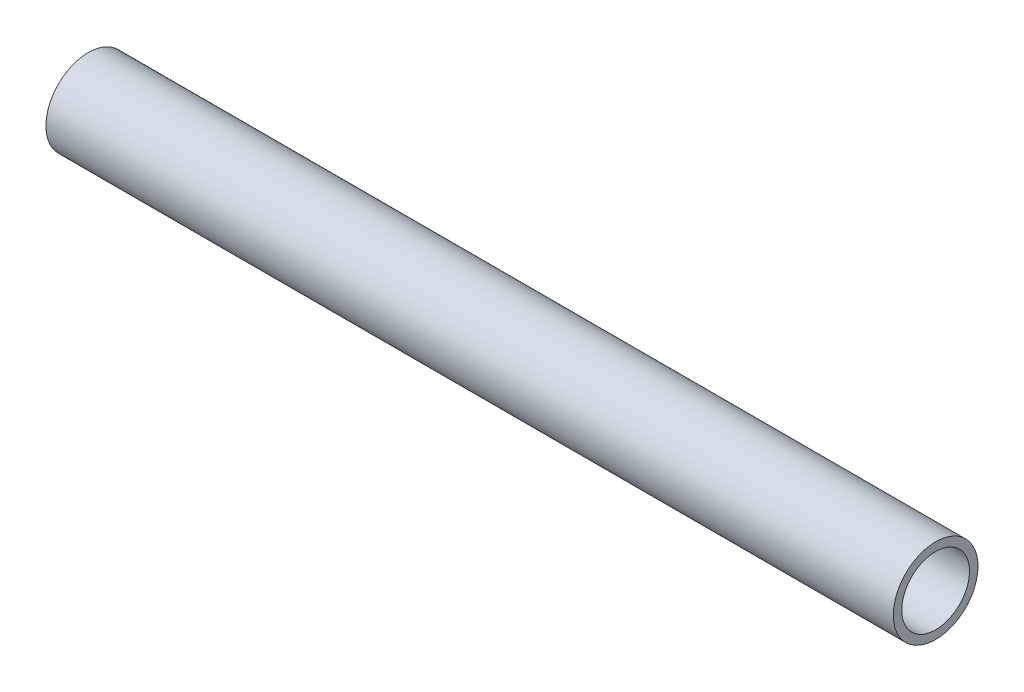
ISO-10303-21;
HEADER;
FILE_DESCRIPTION(('STEP AP214'),'2;1');
FILE_NAME('part.step','',(''),(''),'','','');
FILE_SCHEMA(('AUTOMOTIVE_DESIGN { 1 0 10303 214 1 1 1 1 }'));
ENDSEC;
DATA;
#1=APPLICATION_CONTEXT('core data for automotive mechanical design processes');
#2=APPLICATION_PROTOCOL_DEFINITION('international standard','automotive_design',2000,#1);
#3=PRODUCT_CONTEXT('',#1,'mechanical');
#4=PRODUCT('Part','Part','',(#3));
#5=PRODUCT_RELATED_PRODUCT_CATEGORY('part','',(#4));
#6=PRODUCT_DEFINITION_FORMATION('','',#4);
#7=PRODUCT_DEFINITION_CONTEXT('part definition',#1,'design');
#8=PRODUCT_DEFINITION('design','',#6,#7);
#9=PRODUCT_DEFINITION_SHAPE('','',#8);
#10=(LENGTH_UNIT() NAMED_UNIT(*) SI_UNIT(.MILLI.,.METRE.));
#11=(NAMED_UNIT(*) PLANE_ANGLE_UNIT() SI_UNIT($,.RADIAN.));
#12=(NAMED_UNIT(*) SI_UNIT($,.STERADIAN.) SOLID_ANGLE_UNIT());
#13=UNCERTAINTY_MEASURE_WITH_UNIT(LENGTH_MEASURE(1.E-05),#10,'distance_accuracy_value','');
#14=(GEOMETRIC_REPRESENTATION_CONTEXT(3) GLOBAL_UNCERTAINTY_ASSIGNED_CONTEXT((#13)) GLOBAL_UNIT_ASSIGNED_CONTEXT((#10,
#11,#12)) REPRESENTATION_CONTEXT('',''));
#15=CARTESIAN_POINT('',(0.,0.,0.));
#16=DIRECTION('',(0.,0.,1.));
#17=DIRECTION('',(1.,0.,0.));
#18=AXIS2_PLACEMENT_3D('',#15,#16,#17);
#19=CARTESIAN_POINT('',(254.,0.,0.));
#20=DIRECTION('',(-1.,0.,0.));
#21=DIRECTION('',(0.,0.,1.));
#22=AXIS2_PLACEMENT_3D('',#19,#20,#21);
#23=CYLINDRICAL_SURFACE('',#22,10.16);
#24=CARTESIAN_POINT('',(254.,0.,0.));
#25=DIRECTION('',(1.,0.,0.));
#26=DIRECTION('',(0.,0.,-1.));
#27=AXIS2_PLACEMENT_3D('',#24,#25,#26);
#28=CIRCLE('',#27,10.16);
#29=CARTESIAN_POINT('',(254.,0.,-10.16));
#30=VERTEX_POINT('',#29);
#31=EDGE_CURVE('E47',#30,#30,#28,.T.);
#32=ORIENTED_EDGE('',*,*,#31,.T.);
#33=EDGE_LOOP('',(#32));
#34=FACE_BOUND('',#33,.T.);
#35=CARTESIAN_POINT('',(0.,0.,0.));
#36=DIRECTION('',(1.,0.,0.));
#37=DIRECTION('',(0.,0.,-1.));
#38=AXIS2_PLACEMENT_3D('',#35,#36,#37);
#39=CIRCLE('',#38,10.16);
#40=CARTESIAN_POINT('',(0.,0.,-10.16));
#41=VERTEX_POINT('',#40);
#42=EDGE_CURVE('E53',#41,#41,#39,.T.);
#43=ORIENTED_EDGE('',*,*,#42,.F.);
#44=EDGE_LOOP('',(#43));
#45=FACE_BOUND('',#44,.T.);
#46=ADVANCED_FACE('F40',(#34,#45),#23,.F.);
#47=CARTESIAN_POINT('',(254.,0.,0.));
#48=DIRECTION('',(-1.,0.,0.));
#49=DIRECTION('',(0.,0.,1.));
#50=AXIS2_PLACEMENT_3D('',#47,#48,#49);
#51=CYLINDRICAL_SURFACE('',#50,12.7);
#52=CARTESIAN_POINT('',(254.,0.,0.));
#53=DIRECTION('',(1.,0.,0.));
#54=DIRECTION('',(0.,0.,-1.));
#55=AXIS2_PLACEMENT_3D('',#52,#53,#54);
#56=CIRCLE('',#55,12.7);
#57=CARTESIAN_POINT('',(254.,0.,-12.7));
#58=VERTEX_POINT('',#57);
#59=EDGE_CURVE('E11',#58,#58,#56,.T.);
#60=ORIENTED_EDGE('',*,*,#59,.F.);
#61=EDGE_LOOP('',(#60));
#62=FACE_BOUND('',#61,.T.);
#63=CARTESIAN_POINT('',(0.,0.,0.));
#64=DIRECTION('',(1.,0.,0.));
#65=DIRECTION('',(0.,0.,-1.));
#66=AXIS2_PLACEMENT_3D('',#63,#64,#65);
#67=CIRCLE('',#66,12.7);
#68=CARTESIAN_POINT('',(0.,0.,-12.7));
#69=VERTEX_POINT('',#68);
#70=EDGE_CURVE('E43',#69,#69,#67,.T.);
#71=ORIENTED_EDGE('',*,*,#70,.T.);
#72=EDGE_LOOP('',(#71));
#73=FACE_BOUND('',#72,.T.);
#74=ADVANCED_FACE('F60',(#62,#73),#51,.T.);
#75=CARTESIAN_POINT('',(254.,0.,0.));
#76=DIRECTION('',(1.,0.,0.));
#77=DIRECTION('',(0.,0.,-1.));
#78=AXIS2_PLACEMENT_3D('',#75,#76,#77);
#79=PLANE('',#78);
#80=ORIENTED_EDGE('',*,*,#31,.F.);
#81=EDGE_LOOP('',(#80));
#82=FACE_BOUND('',#81,.T.);
#83=ORIENTED_EDGE('',*,*,#59,.T.);
#84=EDGE_LOOP('',(#83));
#85=FACE_BOUND('',#84,.T.);
#86=ADVANCED_FACE('F64',(#82,#85),#79,.T.);
#87=CARTESIAN_POINT('',(0.,0.,0.));
#88=DIRECTION('',(1.,0.,0.));
#89=DIRECTION('',(0.,0.,-1.));
#90=AXIS2_PLACEMENT_3D('',#87,#88,#89);
#91=PLANE('',#90);
#92=ORIENTED_EDGE('',*,*,#42,.T.);
#93=EDGE_LOOP('',(#92));
#94=FACE_BOUND('',#93,.T.);
#95=ORIENTED_EDGE('',*,*,#70,.F.);
#96=EDGE_LOOP('',(#95));
#97=FACE_BOUND('',#96,.T.);
#98=ADVANCED_FACE('F62',(#94,#97),#91,.F.);
#99=CLOSED_SHELL('',(#46,#74,#86,#98));
#100=MANIFOLD_SOLID_BREP('B2',#99);
#101=ADVANCED_BREP_SHAPE_REPRESENTATION('',(#18,#100),#14);
#102=SHAPE_DEFINITION_REPRESENTATION(#9,#101);
ENDSEC;
END-ISO-10303-21;
